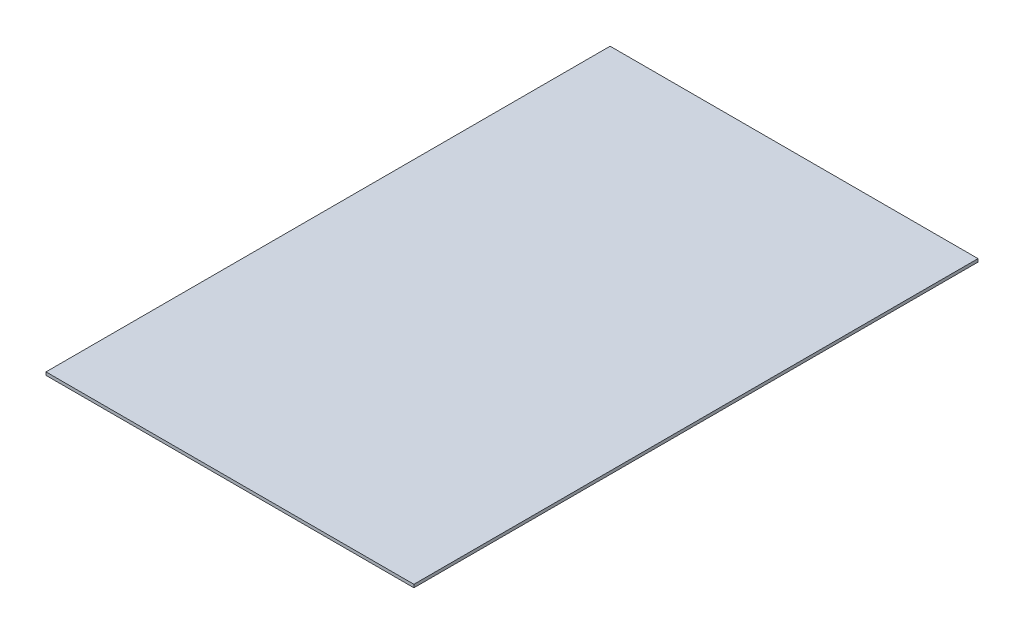
ISO-10303-21;
HEADER;
FILE_DESCRIPTION(('STEP AP214'),'2;1');
FILE_NAME('part.step','',(''),(''),'','','');
FILE_SCHEMA(('AUTOMOTIVE_DESIGN { 1 0 10303 214 1 1 1 1 }'));
ENDSEC;
DATA;
#1=APPLICATION_CONTEXT('core data for automotive mechanical design processes');
#2=APPLICATION_PROTOCOL_DEFINITION('international standard','automotive_design',2000,#1);
#3=PRODUCT_CONTEXT('',#1,'mechanical');
#4=PRODUCT('Part','Part','',(#3));
#5=PRODUCT_RELATED_PRODUCT_CATEGORY('part','',(#4));
#6=PRODUCT_DEFINITION_FORMATION('','',#4);
#7=PRODUCT_DEFINITION_CONTEXT('part definition',#1,'design');
#8=PRODUCT_DEFINITION('design','',#6,#7);
#9=PRODUCT_DEFINITION_SHAPE('','',#8);
#10=(LENGTH_UNIT() NAMED_UNIT(*) SI_UNIT(.MILLI.,.METRE.));
#11=(NAMED_UNIT(*) PLANE_ANGLE_UNIT() SI_UNIT($,.RADIAN.));
#12=(NAMED_UNIT(*) SI_UNIT($,.STERADIAN.) SOLID_ANGLE_UNIT());
#13=UNCERTAINTY_MEASURE_WITH_UNIT(LENGTH_MEASURE(1.E-05),#10,'distance_accuracy_value','');
#14=(GEOMETRIC_REPRESENTATION_CONTEXT(3) GLOBAL_UNCERTAINTY_ASSIGNED_CONTEXT((#13)) GLOBAL_UNIT_ASSIGNED_CONTEXT((#10,
#11,#12)) REPRESENTATION_CONTEXT('',''));
#15=CARTESIAN_POINT('',(0.,0.,0.));
#16=DIRECTION('',(0.,0.,1.));
#17=DIRECTION('',(1.,0.,0.));
#18=AXIS2_PLACEMENT_3D('',#15,#16,#17);
#19=CARTESIAN_POINT('',(0.,5.,0.));
#20=DIRECTION('',(1.,0.,0.));
#21=DIRECTION('',(0.,0.,-1.));
#22=AXIS2_PLACEMENT_3D('',#19,#20,#21);
#23=PLANE('',#22);
#24=DIRECTION('',(0.,0.,1.));
#25=VECTOR('',#24,1.);
#26=CARTESIAN_POINT('',(0.,0.,0.));
#27=LINE('',#26,#25);
#28=CARTESIAN_POINT('',(0.,0.,-920.));
#29=VERTEX_POINT('',#28);
#30=CARTESIAN_POINT('',(0.,0.,0.));
#31=VERTEX_POINT('',#30);
#32=EDGE_CURVE('E107',#29,#31,#27,.T.);
#33=ORIENTED_EDGE('',*,*,#32,.T.);
#34=DIRECTION('',(0.,-1.,0.));
#35=VECTOR('',#34,1.);
#36=CARTESIAN_POINT('',(0.,5.,0.));
#37=LINE('',#36,#35);
#38=CARTESIAN_POINT('',(0.,5.,0.));
#39=VERTEX_POINT('',#38);
#40=EDGE_CURVE('E11',#39,#31,#37,.T.);
#41=ORIENTED_EDGE('',*,*,#40,.F.);
#42=DIRECTION('',(0.,0.,1.));
#43=VECTOR('',#42,1.);
#44=CARTESIAN_POINT('',(0.,5.,0.));
#45=LINE('',#44,#43);
#46=CARTESIAN_POINT('',(0.,5.,-920.));
#47=VERTEX_POINT('',#46);
#48=EDGE_CURVE('E91',#47,#39,#45,.T.);
#49=ORIENTED_EDGE('',*,*,#48,.F.);
#50=DIRECTION('',(0.,-1.,0.));
#51=VECTOR('',#50,1.);
#52=CARTESIAN_POINT('',(0.,5.,-920.));
#53=LINE('',#52,#51);
#54=EDGE_CURVE('E103',#47,#29,#53,.T.);
#55=ORIENTED_EDGE('',*,*,#54,.T.);
#56=EDGE_LOOP('',(#33,#41,#49,#55));
#57=FACE_BOUND('',#56,.T.);
#58=ADVANCED_FACE('F39',(#57),#23,.F.);
#59=CARTESIAN_POINT('',(0.,5.,0.));
#60=DIRECTION('',(0.,0.,-1.));
#61=DIRECTION('',(-1.,0.,0.));
#62=AXIS2_PLACEMENT_3D('',#59,#60,#61);
#63=PLANE('',#62);
#64=DIRECTION('',(1.,0.,0.));
#65=VECTOR('',#64,1.);
#66=CARTESIAN_POINT('',(0.,0.,0.));
#67=LINE('',#66,#65);
#68=CARTESIAN_POINT('',(600.,0.,0.));
#69=VERTEX_POINT('',#68);
#70=EDGE_CURVE('E96',#31,#69,#67,.T.);
#71=ORIENTED_EDGE('',*,*,#70,.T.);
#72=DIRECTION('',(0.,-1.,0.));
#73=VECTOR('',#72,1.);
#74=CARTESIAN_POINT('',(600.,5.,0.));
#75=LINE('',#74,#73);
#76=CARTESIAN_POINT('',(600.,5.,0.));
#77=VERTEX_POINT('',#76);
#78=EDGE_CURVE('E48',#77,#69,#75,.T.);
#79=ORIENTED_EDGE('',*,*,#78,.F.);
#80=DIRECTION('',(1.,0.,0.));
#81=VECTOR('',#80,1.);
#82=CARTESIAN_POINT('',(0.,5.,0.));
#83=LINE('',#82,#81);
#84=EDGE_CURVE('E86',#39,#77,#83,.T.);
#85=ORIENTED_EDGE('',*,*,#84,.F.);
#86=ORIENTED_EDGE('',*,*,#40,.T.);
#87=EDGE_LOOP('',(#71,#79,#85,#86));
#88=FACE_BOUND('',#87,.T.);
#89=ADVANCED_FACE('F95',(#88),#63,.F.);
#90=CARTESIAN_POINT('',(600.,5.,0.));
#91=DIRECTION('',(-1.,0.,0.));
#92=DIRECTION('',(0.,0.,1.));
#93=AXIS2_PLACEMENT_3D('',#90,#91,#92);
#94=PLANE('',#93);
#95=DIRECTION('',(0.,0.,-1.));
#96=VECTOR('',#95,1.);
#97=CARTESIAN_POINT('',(600.,0.,0.));
#98=LINE('',#97,#96);
#99=CARTESIAN_POINT('',(600.,0.,-920.));
#100=VERTEX_POINT('',#99);
#101=EDGE_CURVE('E73',#69,#100,#98,.T.);
#102=ORIENTED_EDGE('',*,*,#101,.T.);
#103=DIRECTION('',(0.,-1.,0.));
#104=VECTOR('',#103,1.);
#105=CARTESIAN_POINT('',(600.,5.,-920.));
#106=LINE('',#105,#104);
#107=CARTESIAN_POINT('',(600.,5.,-920.));
#108=VERTEX_POINT('',#107);
#109=EDGE_CURVE('E98',#108,#100,#106,.T.);
#110=ORIENTED_EDGE('',*,*,#109,.F.);
#111=DIRECTION('',(0.,0.,-1.));
#112=VECTOR('',#111,1.);
#113=CARTESIAN_POINT('',(600.,5.,0.));
#114=LINE('',#113,#112);
#115=EDGE_CURVE('E89',#77,#108,#114,.T.);
#116=ORIENTED_EDGE('',*,*,#115,.F.);
#117=ORIENTED_EDGE('',*,*,#78,.T.);
#118=EDGE_LOOP('',(#102,#110,#116,#117));
#119=FACE_BOUND('',#118,.T.);
#120=ADVANCED_FACE('F99',(#119),#94,.F.);
#121=CARTESIAN_POINT('',(0.,5.,-920.));
#122=DIRECTION('',(0.,0.,1.));
#123=DIRECTION('',(1.,0.,0.));
#124=AXIS2_PLACEMENT_3D('',#121,#122,#123);
#125=PLANE('',#124);
#126=DIRECTION('',(-1.,0.,0.));
#127=VECTOR('',#126,1.);
#128=CARTESIAN_POINT('',(0.,0.,-920.));
#129=LINE('',#128,#127);
#130=EDGE_CURVE('E79',#100,#29,#129,.T.);
#131=ORIENTED_EDGE('',*,*,#130,.T.);
#132=ORIENTED_EDGE('',*,*,#54,.F.);
#133=DIRECTION('',(-1.,0.,0.));
#134=VECTOR('',#133,1.);
#135=CARTESIAN_POINT('',(0.,5.,-920.));
#136=LINE('',#135,#134);
#137=EDGE_CURVE('E56',#108,#47,#136,.T.);
#138=ORIENTED_EDGE('',*,*,#137,.F.);
#139=ORIENTED_EDGE('',*,*,#109,.T.);
#140=EDGE_LOOP('',(#131,#132,#138,#139));
#141=FACE_BOUND('',#140,.T.);
#142=ADVANCED_FACE('F120',(#141),#125,.F.);
#143=CARTESIAN_POINT('',(0.,5.,0.));
#144=DIRECTION('',(0.,-1.,0.));
#145=DIRECTION('',(0.,0.,-1.));
#146=AXIS2_PLACEMENT_3D('',#143,#144,#145);
#147=PLANE('',#146);
#148=ORIENTED_EDGE('',*,*,#48,.T.);
#149=ORIENTED_EDGE('',*,*,#84,.T.);
#150=ORIENTED_EDGE('',*,*,#115,.T.);
#151=ORIENTED_EDGE('',*,*,#137,.T.);
#152=EDGE_LOOP('',(#148,#149,#150,#151));
#153=FACE_BOUND('',#152,.T.);
#154=ADVANCED_FACE('F87',(#153),#147,.F.);
#155=CARTESIAN_POINT('',(0.,0.,0.));
#156=DIRECTION('',(0.,-1.,0.));
#157=DIRECTION('',(0.,0.,-1.));
#158=AXIS2_PLACEMENT_3D('',#155,#156,#157);
#159=PLANE('',#158);
#160=ORIENTED_EDGE('',*,*,#32,.F.);
#161=ORIENTED_EDGE('',*,*,#130,.F.);
#162=ORIENTED_EDGE('',*,*,#101,.F.);
#163=ORIENTED_EDGE('',*,*,#70,.F.);
#164=EDGE_LOOP('',(#160,#161,#162,#163));
#165=FACE_BOUND('',#164,.T.);
#166=ADVANCED_FACE('F123',(#165),#159,.T.);
#167=CLOSED_SHELL('',(#58,#89,#120,#142,#154,#166));
#168=MANIFOLD_SOLID_BREP('B2',#167);
#169=ADVANCED_BREP_SHAPE_REPRESENTATION('',(#18,#168),#14);
#170=SHAPE_DEFINITION_REPRESENTATION(#9,#169);
ENDSEC;
END-ISO-10303-21;
